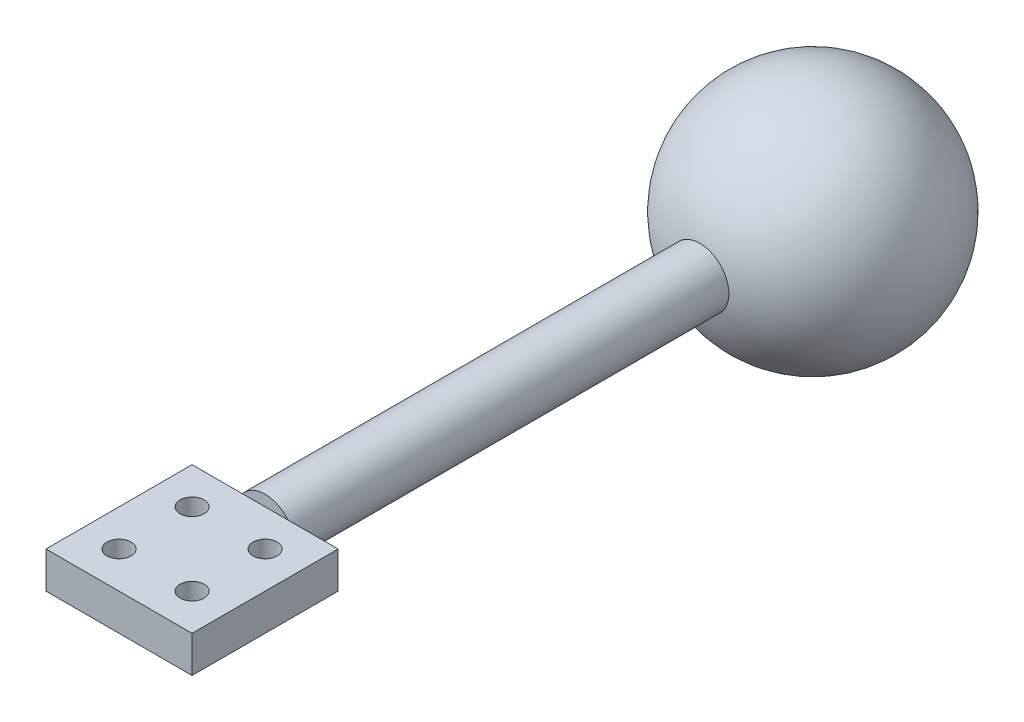
ISO-10303-21;
HEADER;
FILE_DESCRIPTION(('STEP AP214'),'2;1');
FILE_NAME('part.step','',(''),(''),'','','');
FILE_SCHEMA(('AUTOMOTIVE_DESIGN { 1 0 10303 214 1 1 1 1 }'));
ENDSEC;
DATA;
#1=APPLICATION_CONTEXT('core data for automotive mechanical design processes');
#2=APPLICATION_PROTOCOL_DEFINITION('international standard','automotive_design',2000,#1);
#3=PRODUCT_CONTEXT('',#1,'mechanical');
#4=PRODUCT('Part','Part','',(#3));
#5=PRODUCT_RELATED_PRODUCT_CATEGORY('part','',(#4));
#6=PRODUCT_DEFINITION_FORMATION('','',#4);
#7=PRODUCT_DEFINITION_CONTEXT('part definition',#1,'design');
#8=PRODUCT_DEFINITION('design','',#6,#7);
#9=PRODUCT_DEFINITION_SHAPE('','',#8);
#10=(LENGTH_UNIT() NAMED_UNIT(*) SI_UNIT(.MILLI.,.METRE.));
#11=(NAMED_UNIT(*) PLANE_ANGLE_UNIT() SI_UNIT($,.RADIAN.));
#12=(NAMED_UNIT(*) SI_UNIT($,.STERADIAN.) SOLID_ANGLE_UNIT());
#13=UNCERTAINTY_MEASURE_WITH_UNIT(LENGTH_MEASURE(1.E-05),#10,'distance_accuracy_value','');
#14=(GEOMETRIC_REPRESENTATION_CONTEXT(3) GLOBAL_UNCERTAINTY_ASSIGNED_CONTEXT((#13)) GLOBAL_UNIT_ASSIGNED_CONTEXT((#10,
#11,#12)) REPRESENTATION_CONTEXT('',''));
#15=CARTESIAN_POINT('',(0.,0.,0.));
#16=DIRECTION('',(0.,0.,1.));
#17=DIRECTION('',(1.,0.,0.));
#18=AXIS2_PLACEMENT_3D('',#15,#16,#17);
#19=CARTESIAN_POINT('',(0.,0.,75.));
#20=DIRECTION('',(0.,0.,1.));
#21=DIRECTION('',(1.,0.,0.));
#22=AXIS2_PLACEMENT_3D('',#19,#20,#21);
#23=PLANE('',#22);
#24=CARTESIAN_POINT('',(0.,0.,75.));
#25=DIRECTION('',(0.,0.,1.));
#26=DIRECTION('',(1.,0.,0.));
#27=AXIS2_PLACEMENT_3D('',#24,#25,#26);
#28=CIRCLE('',#27,4.);
#29=CARTESIAN_POINT('',(-3.1224989991992,-2.5,75.));
#30=VERTEX_POINT('',#29);
#31=CARTESIAN_POINT('',(3.1224989991992,-2.5,75.));
#32=VERTEX_POINT('',#31);
#33=EDGE_CURVE('E164',#30,#32,#28,.T.);
#34=ORIENTED_EDGE('',*,*,#33,.T.);
#35=DIRECTION('',(-1.,0.,0.));
#36=VECTOR('',#35,1.);
#37=CARTESIAN_POINT('',(0.,-2.5,75.));
#38=LINE('',#37,#36);
#39=EDGE_CURVE('E45',#32,#30,#38,.T.);
#40=ORIENTED_EDGE('',*,*,#39,.T.);
#41=EDGE_LOOP('',(#34,#40));
#42=FACE_BOUND('',#41,.T.);
#43=ADVANCED_FACE('F35',(#42),#23,.T.);
#44=CARTESIAN_POINT('',(0.,0.,0.));
#45=DIRECTION('',(0.,1.,0.));
#46=DIRECTION('',(1.,0.,0.));
#47=AXIS2_PLACEMENT_3D('',#44,#45,#46);
#48=SPHERICAL_SURFACE('',#47,16.);
#49=CARTESIAN_POINT('',(0.,0.,0.));
#50=DIRECTION('',(0.,0.,-1.));
#51=DIRECTION('',(-1.,0.,0.));
#52=AXIS2_PLACEMENT_3D('',#49,#50,#51);
#53=SPHERICAL_SURFACE('',#52,16.);
#54=CARTESIAN_POINT('',(0.,0.,15.4919333848297));
#55=DIRECTION('',(0.,0.,-1.));
#56=DIRECTION('',(-1.,0.,0.));
#57=AXIS2_PLACEMENT_3D('',#54,#55,#56);
#58=CIRCLE('',#57,4.);
#59=CARTESIAN_POINT('',(-4.,0.,15.4919333848297));
#60=VERTEX_POINT('',#59);
#61=EDGE_CURVE('E39',#60,#60,#58,.F.);
#62=ORIENTED_EDGE('',*,*,#61,.F.);
#63=EDGE_LOOP('',(#62));
#64=FACE_BOUND('',#63,.T.);
#65=ADVANCED_FACE('F37',(#64),#53,.T.);
#66=CARTESIAN_POINT('',(0.,0.,75.));
#67=DIRECTION('',(0.,0.,-1.));
#68=DIRECTION('',(-1.,0.,0.));
#69=AXIS2_PLACEMENT_3D('',#66,#67,#68);
#70=CYLINDRICAL_SURFACE('',#69,4.);
#71=CARTESIAN_POINT('',(3.1224989991992,2.5,75.));
#72=VERTEX_POINT('',#71);
#73=CARTESIAN_POINT('',(-3.1224989991992,2.5,75.));
#74=VERTEX_POINT('',#73);
#75=EDGE_CURVE('E157',#72,#74,#28,.T.);
#76=ORIENTED_EDGE('',*,*,#75,.F.);
#77=EDGE_CURVE('E160',#32,#72,#28,.T.);
#78=ORIENTED_EDGE('',*,*,#77,.F.);
#79=ORIENTED_EDGE('',*,*,#33,.F.);
#80=EDGE_CURVE('E159',#74,#30,#28,.T.);
#81=ORIENTED_EDGE('',*,*,#80,.F.);
#82=EDGE_LOOP('',(#76,#78,#79,#81));
#83=FACE_BOUND('',#82,.T.);
#84=ORIENTED_EDGE('',*,*,#61,.T.);
#85=EDGE_LOOP('',(#84));
#86=FACE_BOUND('',#85,.T.);
#87=ADVANCED_FACE('F176',(#83,#86),#70,.T.);
#88=DIRECTION('',(-1.,0.,0.));
#89=VECTOR('',#88,1.);
#90=CARTESIAN_POINT('',(0.,2.5,75.));
#91=LINE('',#90,#89);
#92=EDGE_CURVE('E11',#72,#74,#91,.T.);
#93=ORIENTED_EDGE('',*,*,#92,.F.);
#94=ORIENTED_EDGE('',*,*,#75,.T.);
#95=EDGE_LOOP('',(#93,#94));
#96=FACE_BOUND('',#95,.T.);
#97=ADVANCED_FACE('F180',(#96),#23,.T.);
#98=CARTESIAN_POINT('',(0.,-2.5,75.));
#99=DIRECTION('',(0.,0.,-1.));
#100=DIRECTION('',(-1.,0.,0.));
#101=AXIS2_PLACEMENT_3D('',#98,#99,#100);
#102=PLANE('',#101);
#103=CARTESIAN_POINT('',(-9.99999999999999,2.5,75.));
#104=VERTEX_POINT('',#103);
#105=EDGE_CURVE('E48',#74,#104,#91,.T.);
#106=ORIENTED_EDGE('',*,*,#105,.F.);
#107=ORIENTED_EDGE('',*,*,#80,.T.);
#108=CARTESIAN_POINT('',(-9.99999999999999,-2.5,75.));
#109=VERTEX_POINT('',#108);
#110=EDGE_CURVE('E55',#30,#109,#38,.T.);
#111=ORIENTED_EDGE('',*,*,#110,.T.);
#112=DIRECTION('',(0.,1.,0.));
#113=VECTOR('',#112,1.);
#114=CARTESIAN_POINT('',(-9.99999999999999,-2.5,75.));
#115=LINE('',#114,#113);
#116=EDGE_CURVE('E151',#109,#104,#115,.T.);
#117=ORIENTED_EDGE('',*,*,#116,.T.);
#118=EDGE_LOOP('',(#106,#107,#111,#117));
#119=FACE_BOUND('',#118,.T.);
#120=ADVANCED_FACE('F173',(#119),#102,.T.);
#121=CARTESIAN_POINT('',(-9.99999999999999,-2.5,0.));
#122=DIRECTION('',(1.,0.,0.));
#123=DIRECTION('',(0.,0.,-1.));
#124=AXIS2_PLACEMENT_3D('',#121,#122,#123);
#125=PLANE('',#124);
#126=DIRECTION('',(0.,1.,0.));
#127=VECTOR('',#126,1.);
#128=CARTESIAN_POINT('',(-9.99999999999999,-2.5,95.));
#129=LINE('',#128,#127);
#130=CARTESIAN_POINT('',(-9.99999999999999,-2.5,95.));
#131=VERTEX_POINT('',#130);
#132=CARTESIAN_POINT('',(-9.99999999999999,2.5,95.));
#133=VERTEX_POINT('',#132);
#134=EDGE_CURVE('E93',#131,#133,#129,.T.);
#135=ORIENTED_EDGE('',*,*,#134,.T.);
#136=DIRECTION('',(0.,0.,-1.));
#137=VECTOR('',#136,1.);
#138=CARTESIAN_POINT('',(-9.99999999999999,2.5,0.));
#139=LINE('',#138,#137);
#140=EDGE_CURVE('E97',#133,#104,#139,.T.);
#141=ORIENTED_EDGE('',*,*,#140,.T.);
#142=ORIENTED_EDGE('',*,*,#116,.F.);
#143=DIRECTION('',(0.,0.,-1.));
#144=VECTOR('',#143,1.);
#145=CARTESIAN_POINT('',(-9.99999999999999,-2.5,0.));
#146=LINE('',#145,#144);
#147=EDGE_CURVE('E98',#131,#109,#146,.T.);
#148=ORIENTED_EDGE('',*,*,#147,.F.);
#149=EDGE_LOOP('',(#135,#141,#142,#148));
#150=FACE_BOUND('',#149,.T.);
#151=ADVANCED_FACE('F95',(#150),#125,.F.);
#152=CARTESIAN_POINT('',(10.,-2.5,75.));
#153=VERTEX_POINT('',#152);
#154=EDGE_CURVE('E138',#153,#32,#38,.T.);
#155=ORIENTED_EDGE('',*,*,#154,.T.);
#156=ORIENTED_EDGE('',*,*,#77,.T.);
#157=CARTESIAN_POINT('',(10.,2.5,75.));
#158=VERTEX_POINT('',#157);
#159=EDGE_CURVE('E47',#158,#72,#91,.T.);
#160=ORIENTED_EDGE('',*,*,#159,.F.);
#161=DIRECTION('',(0.,1.,0.));
#162=VECTOR('',#161,1.);
#163=CARTESIAN_POINT('',(10.,-2.5,75.));
#164=LINE('',#163,#162);
#165=EDGE_CURVE('E154',#153,#158,#164,.T.);
#166=ORIENTED_EDGE('',*,*,#165,.F.);
#167=EDGE_LOOP('',(#155,#156,#160,#166));
#168=FACE_BOUND('',#167,.T.);
#169=ADVANCED_FACE('F181',(#168),#102,.T.);
#170=CARTESIAN_POINT('',(10.,-2.5,0.));
#171=DIRECTION('',(1.,0.,0.));
#172=DIRECTION('',(0.,0.,-1.));
#173=AXIS2_PLACEMENT_3D('',#170,#171,#172);
#174=PLANE('',#173);
#175=ORIENTED_EDGE('',*,*,#165,.T.);
#176=DIRECTION('',(0.,0.,-1.));
#177=VECTOR('',#176,1.);
#178=CARTESIAN_POINT('',(10.,2.5,0.));
#179=LINE('',#178,#177);
#180=CARTESIAN_POINT('',(10.,2.5,95.));
#181=VERTEX_POINT('',#180);
#182=EDGE_CURVE('E115',#181,#158,#179,.T.);
#183=ORIENTED_EDGE('',*,*,#182,.F.);
#184=DIRECTION('',(0.,1.,0.));
#185=VECTOR('',#184,1.);
#186=CARTESIAN_POINT('',(10.,-2.5,95.));
#187=LINE('',#186,#185);
#188=CARTESIAN_POINT('',(10.,-2.5,95.));
#189=VERTEX_POINT('',#188);
#190=EDGE_CURVE('E102',#189,#181,#187,.T.);
#191=ORIENTED_EDGE('',*,*,#190,.F.);
#192=DIRECTION('',(0.,0.,-1.));
#193=VECTOR('',#192,1.);
#194=CARTESIAN_POINT('',(10.,-2.5,0.));
#195=LINE('',#194,#193);
#196=EDGE_CURVE('E135',#189,#153,#195,.T.);
#197=ORIENTED_EDGE('',*,*,#196,.T.);
#198=EDGE_LOOP('',(#175,#183,#191,#197));
#199=FACE_BOUND('',#198,.T.);
#200=ADVANCED_FACE('F184',(#199),#174,.T.);
#201=CARTESIAN_POINT('',(-5.,-2.5,80.));
#202=DIRECTION('',(0.,1.,0.));
#203=DIRECTION('',(0.,0.,1.));
#204=AXIS2_PLACEMENT_3D('',#201,#202,#203);
#205=CYLINDRICAL_SURFACE('',#204,1.65);
#206=CARTESIAN_POINT('',(-5.,-2.5,80.));
#207=DIRECTION('',(0.,1.,0.));
#208=DIRECTION('',(0.,0.,1.));
#209=AXIS2_PLACEMENT_3D('',#206,#207,#208);
#210=CIRCLE('',#209,1.65);
#211=CARTESIAN_POINT('',(-5.,-2.5,81.65));
#212=VERTEX_POINT('',#211);
#213=EDGE_CURVE('E146',#212,#212,#210,.T.);
#214=ORIENTED_EDGE('',*,*,#213,.F.);
#215=EDGE_LOOP('',(#214));
#216=FACE_BOUND('',#215,.T.);
#217=CARTESIAN_POINT('',(-5.,2.5,80.));
#218=DIRECTION('',(0.,1.,0.));
#219=DIRECTION('',(0.,0.,1.));
#220=AXIS2_PLACEMENT_3D('',#217,#218,#219);
#221=CIRCLE('',#220,1.65);
#222=CARTESIAN_POINT('',(-5.,2.5,81.65));
#223=VERTEX_POINT('',#222);
#224=EDGE_CURVE('E126',#223,#223,#221,.T.);
#225=ORIENTED_EDGE('',*,*,#224,.T.);
#226=EDGE_LOOP('',(#225));
#227=FACE_BOUND('',#226,.T.);
#228=ADVANCED_FACE('F282',(#216,#227),#205,.F.);
#229=CARTESIAN_POINT('',(-5.,-2.5,90.));
#230=DIRECTION('',(0.,1.,0.));
#231=DIRECTION('',(0.,0.,1.));
#232=AXIS2_PLACEMENT_3D('',#229,#230,#231);
#233=CYLINDRICAL_SURFACE('',#232,1.65);
#234=CARTESIAN_POINT('',(-5.,-2.5,90.));
#235=DIRECTION('',(0.,1.,0.));
#236=DIRECTION('',(0.,0.,1.));
#237=AXIS2_PLACEMENT_3D('',#234,#235,#236);
#238=CIRCLE('',#237,1.65);
#239=CARTESIAN_POINT('',(-5.,-2.5,91.65));
#240=VERTEX_POINT('',#239);
#241=EDGE_CURVE('E143',#240,#240,#238,.F.);
#242=ORIENTED_EDGE('',*,*,#241,.T.);
#243=EDGE_LOOP('',(#242));
#244=FACE_BOUND('',#243,.T.);
#245=CARTESIAN_POINT('',(-5.,2.5,90.));
#246=DIRECTION('',(0.,1.,0.));
#247=DIRECTION('',(0.,0.,1.));
#248=AXIS2_PLACEMENT_3D('',#245,#246,#247);
#249=CIRCLE('',#248,1.65);
#250=CARTESIAN_POINT('',(-5.,2.5,91.65));
#251=VERTEX_POINT('',#250);
#252=EDGE_CURVE('E123',#251,#251,#249,.F.);
#253=ORIENTED_EDGE('',*,*,#252,.F.);
#254=EDGE_LOOP('',(#253));
#255=FACE_BOUND('',#254,.T.);
#256=ADVANCED_FACE('F291',(#244,#255),#233,.F.);
#257=CARTESIAN_POINT('',(5.,-2.5,90.));
#258=DIRECTION('',(0.,1.,0.));
#259=DIRECTION('',(0.,0.,1.));
#260=AXIS2_PLACEMENT_3D('',#257,#258,#259);
#261=CYLINDRICAL_SURFACE('',#260,1.65);
#262=CARTESIAN_POINT('',(5.,-2.5,90.));
#263=DIRECTION('',(0.,1.,0.));
#264=DIRECTION('',(0.,0.,1.));
#265=AXIS2_PLACEMENT_3D('',#262,#263,#264);
#266=CIRCLE('',#265,1.65);
#267=CARTESIAN_POINT('',(5.,-2.5,91.65));
#268=VERTEX_POINT('',#267);
#269=EDGE_CURVE('E140',#268,#268,#266,.T.);
#270=ORIENTED_EDGE('',*,*,#269,.F.);
#271=EDGE_LOOP('',(#270));
#272=FACE_BOUND('',#271,.T.);
#273=CARTESIAN_POINT('',(5.,2.5,90.));
#274=DIRECTION('',(0.,1.,0.));
#275=DIRECTION('',(0.,0.,1.));
#276=AXIS2_PLACEMENT_3D('',#273,#274,#275);
#277=CIRCLE('',#276,1.65);
#278=CARTESIAN_POINT('',(5.,2.5,91.65));
#279=VERTEX_POINT('',#278);
#280=EDGE_CURVE('E120',#279,#279,#277,.T.);
#281=ORIENTED_EDGE('',*,*,#280,.T.);
#282=EDGE_LOOP('',(#281));
#283=FACE_BOUND('',#282,.T.);
#284=ADVANCED_FACE('F301',(#272,#283),#261,.F.);
#285=CARTESIAN_POINT('',(1.31838984174237E-13,-2.5,95.));
#286=DIRECTION('',(0.,0.,-1.));
#287=DIRECTION('',(-1.,0.,0.));
#288=AXIS2_PLACEMENT_3D('',#285,#286,#287);
#289=PLANE('',#288);
#290=ORIENTED_EDGE('',*,*,#190,.T.);
#291=DIRECTION('',(-1.,0.,0.));
#292=VECTOR('',#291,1.);
#293=CARTESIAN_POINT('',(1.31838984174237E-13,2.5,95.));
#294=LINE('',#293,#292);
#295=EDGE_CURVE('E110',#181,#133,#294,.T.);
#296=ORIENTED_EDGE('',*,*,#295,.T.);
#297=ORIENTED_EDGE('',*,*,#134,.F.);
#298=DIRECTION('',(-1.,0.,0.));
#299=VECTOR('',#298,1.);
#300=CARTESIAN_POINT('',(1.31838984174237E-13,-2.5,95.));
#301=LINE('',#300,#299);
#302=EDGE_CURVE('E133',#189,#131,#301,.T.);
#303=ORIENTED_EDGE('',*,*,#302,.F.);
#304=EDGE_LOOP('',(#290,#296,#297,#303));
#305=FACE_BOUND('',#304,.T.);
#306=ADVANCED_FACE('F113',(#305),#289,.F.);
#307=CARTESIAN_POINT('',(5.,-2.5,80.));
#308=DIRECTION('',(0.,1.,0.));
#309=DIRECTION('',(0.,0.,1.));
#310=AXIS2_PLACEMENT_3D('',#307,#308,#309);
#311=CYLINDRICAL_SURFACE('',#310,1.65);
#312=CARTESIAN_POINT('',(5.,-2.5,80.));
#313=DIRECTION('',(0.,1.,0.));
#314=DIRECTION('',(0.,0.,1.));
#315=AXIS2_PLACEMENT_3D('',#312,#313,#314);
#316=CIRCLE('',#315,1.65);
#317=CARTESIAN_POINT('',(5.,-2.5,81.65));
#318=VERTEX_POINT('',#317);
#319=EDGE_CURVE('E103',#318,#318,#316,.F.);
#320=ORIENTED_EDGE('',*,*,#319,.T.);
#321=EDGE_LOOP('',(#320));
#322=FACE_BOUND('',#321,.T.);
#323=CARTESIAN_POINT('',(5.,2.5,80.));
#324=DIRECTION('',(0.,1.,0.));
#325=DIRECTION('',(0.,0.,1.));
#326=AXIS2_PLACEMENT_3D('',#323,#324,#325);
#327=CIRCLE('',#326,1.65);
#328=CARTESIAN_POINT('',(5.,2.5,81.65));
#329=VERTEX_POINT('',#328);
#330=EDGE_CURVE('E129',#329,#329,#327,.F.);
#331=ORIENTED_EDGE('',*,*,#330,.F.);
#332=EDGE_LOOP('',(#331));
#333=FACE_BOUND('',#332,.T.);
#334=ADVANCED_FACE('F188',(#322,#333),#311,.F.);
#335=CARTESIAN_POINT('',(0.,-2.5,0.));
#336=DIRECTION('',(0.,1.,0.));
#337=DIRECTION('',(0.,0.,1.));
#338=AXIS2_PLACEMENT_3D('',#335,#336,#337);
#339=PLANE('',#338);
#340=ORIENTED_EDGE('',*,*,#147,.T.);
#341=ORIENTED_EDGE('',*,*,#110,.F.);
#342=ORIENTED_EDGE('',*,*,#39,.F.);
#343=ORIENTED_EDGE('',*,*,#154,.F.);
#344=ORIENTED_EDGE('',*,*,#196,.F.);
#345=ORIENTED_EDGE('',*,*,#302,.T.);
#346=EDGE_LOOP('',(#340,#341,#342,#343,#344,#345));
#347=FACE_BOUND('',#346,.T.);
#348=ORIENTED_EDGE('',*,*,#269,.T.);
#349=EDGE_LOOP('',(#348));
#350=FACE_BOUND('',#349,.T.);
#351=ORIENTED_EDGE('',*,*,#241,.F.);
#352=EDGE_LOOP('',(#351));
#353=FACE_BOUND('',#352,.T.);
#354=ORIENTED_EDGE('',*,*,#213,.T.);
#355=EDGE_LOOP('',(#354));
#356=FACE_BOUND('',#355,.T.);
#357=ORIENTED_EDGE('',*,*,#319,.F.);
#358=EDGE_LOOP('',(#357));
#359=FACE_BOUND('',#358,.T.);
#360=ADVANCED_FACE('F185',(#347,#350,#353,#356,#359),#339,.F.);
#361=CARTESIAN_POINT('',(0.,2.5,0.));
#362=DIRECTION('',(0.,1.,0.));
#363=DIRECTION('',(0.,0.,1.));
#364=AXIS2_PLACEMENT_3D('',#361,#362,#363);
#365=PLANE('',#364);
#366=ORIENTED_EDGE('',*,*,#140,.F.);
#367=ORIENTED_EDGE('',*,*,#295,.F.);
#368=ORIENTED_EDGE('',*,*,#182,.T.);
#369=ORIENTED_EDGE('',*,*,#159,.T.);
#370=ORIENTED_EDGE('',*,*,#92,.T.);
#371=ORIENTED_EDGE('',*,*,#105,.T.);
#372=EDGE_LOOP('',(#366,#367,#368,#369,#370,#371));
#373=FACE_BOUND('',#372,.T.);
#374=ORIENTED_EDGE('',*,*,#280,.F.);
#375=EDGE_LOOP('',(#374));
#376=FACE_BOUND('',#375,.T.);
#377=ORIENTED_EDGE('',*,*,#252,.T.);
#378=EDGE_LOOP('',(#377));
#379=FACE_BOUND('',#378,.T.);
#380=ORIENTED_EDGE('',*,*,#224,.F.);
#381=EDGE_LOOP('',(#380));
#382=FACE_BOUND('',#381,.T.);
#383=ORIENTED_EDGE('',*,*,#330,.T.);
#384=EDGE_LOOP('',(#383));
#385=FACE_BOUND('',#384,.T.);
#386=ADVANCED_FACE('F107',(#373,#376,#379,#382,#385),#365,.T.);
#387=CLOSED_SHELL('',(#43,#65,#87,#97,#120,#151,#169,#200,#228,#256,#284,#306,#334,#360,#386));
#388=CARTESIAN_POINT('',(0.,0.,0.));
#389=DIRECTION('',(0.,1.,0.));
#390=DIRECTION('',(1.,0.,0.));
#391=AXIS2_PLACEMENT_3D('',#388,#389,#390);
#392=SPHERICAL_SURFACE('',#391,4.);
#393=CARTESIAN_POINT('',(0.,0.,0.));
#394=DIRECTION('',(0.,0.,1.));
#395=DIRECTION('',(1.,0.,0.));
#396=AXIS2_PLACEMENT_3D('',#393,#394,#395);
#397=SPHERICAL_SURFACE('',#396,4.);
#398=CARTESIAN_POINT('',(0.,0.,0.));
#399=DIRECTION('',(0.,0.,1.));
#400=DIRECTION('',(1.,0.,0.));
#401=AXIS2_PLACEMENT_3D('',#398,#399,#400);
#402=CIRCLE('',#401,4.);
#403=CARTESIAN_POINT('',(4.,0.,0.));
#404=VERTEX_POINT('',#403);
#405=EDGE_CURVE('E153',#404,#404,#402,.T.);
#406=ORIENTED_EDGE('',*,*,#405,.T.);
#407=EDGE_LOOP('',(#406));
#408=FACE_BOUND('',#407,.T.);
#409=ADVANCED_FACE('F226',(#408),#397,.F.);
#410=CARTESIAN_POINT('',(0.,0.,0.));
#411=DIRECTION('',(0.,0.,1.));
#412=DIRECTION('',(1.,0.,0.));
#413=AXIS2_PLACEMENT_3D('',#410,#411,#412);
#414=PLANE('',#413);
#415=ORIENTED_EDGE('',*,*,#405,.F.);
#416=EDGE_LOOP('',(#415));
#417=FACE_BOUND('',#416,.T.);
#418=ADVANCED_FACE('F225',(#417),#414,.F.);
#419=CLOSED_SHELL('',(#409,#418));
#420=ORIENTED_CLOSED_SHELL('',*,#419,.T.);
#421=BREP_WITH_VOIDS('B2',#387,(#420));
#422=ADVANCED_BREP_SHAPE_REPRESENTATION('',(#18,#421),#14);
#423=SHAPE_DEFINITION_REPRESENTATION(#9,#422);
ENDSEC;
END-ISO-10303-21;
